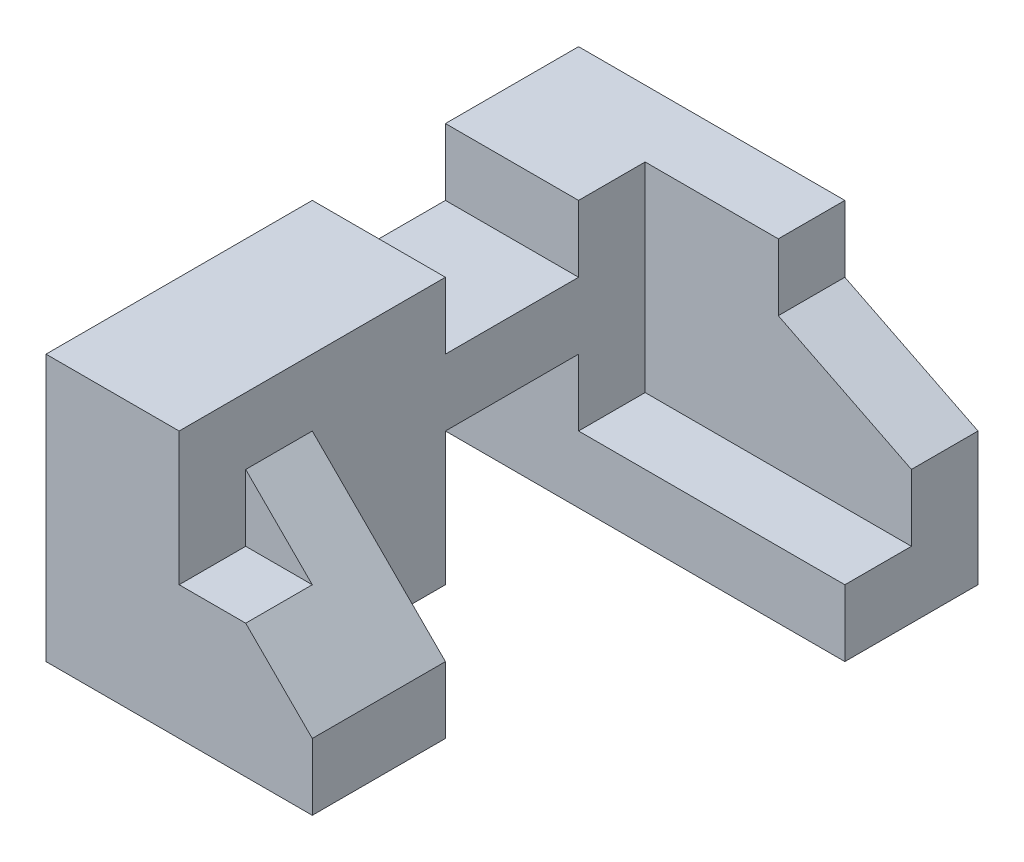
ISO-10303-21;
HEADER;
FILE_DESCRIPTION(('STEP AP214'),'2;1');
FILE_NAME('part.step','',(''),(''),'','','');
FILE_SCHEMA(('AUTOMOTIVE_DESIGN { 1 0 10303 214 1 1 1 1 }'));
ENDSEC;
DATA;
#1=APPLICATION_CONTEXT('core data for automotive mechanical design processes');
#2=APPLICATION_PROTOCOL_DEFINITION('international standard','automotive_design',2000,#1);
#3=PRODUCT_CONTEXT('',#1,'mechanical');
#4=PRODUCT('Part','Part','',(#3));
#5=PRODUCT_RELATED_PRODUCT_CATEGORY('part','',(#4));
#6=PRODUCT_DEFINITION_FORMATION('','',#4);
#7=PRODUCT_DEFINITION_CONTEXT('part definition',#1,'design');
#8=PRODUCT_DEFINITION('design','',#6,#7);
#9=PRODUCT_DEFINITION_SHAPE('','',#8);
#10=(LENGTH_UNIT() NAMED_UNIT(*) SI_UNIT(.MILLI.,.METRE.));
#11=(NAMED_UNIT(*) PLANE_ANGLE_UNIT() SI_UNIT($,.RADIAN.));
#12=(NAMED_UNIT(*) SI_UNIT($,.STERADIAN.) SOLID_ANGLE_UNIT());
#13=UNCERTAINTY_MEASURE_WITH_UNIT(LENGTH_MEASURE(1.E-05),#10,'distance_accuracy_value','');
#14=(GEOMETRIC_REPRESENTATION_CONTEXT(3) GLOBAL_UNCERTAINTY_ASSIGNED_CONTEXT((#13)) GLOBAL_UNIT_ASSIGNED_CONTEXT((#10,
#11,#12)) REPRESENTATION_CONTEXT('',''));
#15=CARTESIAN_POINT('',(0.,0.,0.));
#16=DIRECTION('',(0.,0.,1.));
#17=DIRECTION('',(1.,0.,0.));
#18=AXIS2_PLACEMENT_3D('',#15,#16,#17);
#19=CARTESIAN_POINT('',(3.,-2.,8.));
#20=DIRECTION('',(0.,1.,0.));
#21=DIRECTION('',(-1.,0.,0.));
#22=AXIS2_PLACEMENT_3D('',#19,#20,#21);
#23=PLANE('',#22);
#24=DIRECTION('',(1.,0.,0.));
#25=VECTOR('',#24,1.);
#26=CARTESIAN_POINT('',(-1.,-2.,6.));
#27=LINE('',#26,#25);
#28=CARTESIAN_POINT('',(-1.,-2.,6.));
#29=VERTEX_POINT('',#28);
#30=CARTESIAN_POINT('',(0.999999999999999,-2.,6.));
#31=VERTEX_POINT('',#30);
#32=EDGE_CURVE('E268',#29,#31,#27,.T.);
#33=ORIENTED_EDGE('',*,*,#32,.T.);
#34=DIRECTION('',(0.,0.,1.));
#35=VECTOR('',#34,1.);
#36=CARTESIAN_POINT('',(0.999999999999999,-2.,6.));
#37=LINE('',#36,#35);
#38=CARTESIAN_POINT('',(0.999999999999999,-2.,8.));
#39=VERTEX_POINT('',#38);
#40=EDGE_CURVE('E48',#31,#39,#37,.T.);
#41=ORIENTED_EDGE('',*,*,#40,.T.);
#42=DIRECTION('',(1.,0.,0.));
#43=VECTOR('',#42,1.);
#44=CARTESIAN_POINT('',(3.,-2.,8.));
#45=LINE('',#44,#43);
#46=CARTESIAN_POINT('',(-3.,-2.,8.));
#47=VERTEX_POINT('',#46);
#48=EDGE_CURVE('E327',#47,#39,#45,.T.);
#49=ORIENTED_EDGE('',*,*,#48,.F.);
#50=DIRECTION('',(0.,0.,-1.));
#51=VECTOR('',#50,1.);
#52=CARTESIAN_POINT('',(-3.,-2.,8.));
#53=LINE('',#52,#51);
#54=CARTESIAN_POINT('',(-3.,-2.,4.));
#55=VERTEX_POINT('',#54);
#56=EDGE_CURVE('E11',#47,#55,#53,.T.);
#57=ORIENTED_EDGE('',*,*,#56,.T.);
#58=DIRECTION('',(1.,0.,0.));
#59=VECTOR('',#58,1.);
#60=CARTESIAN_POINT('',(-3.,-2.,4.));
#61=LINE('',#60,#59);
#62=CARTESIAN_POINT('',(-1.,-2.,4.));
#63=VERTEX_POINT('',#62);
#64=EDGE_CURVE('E257',#55,#63,#61,.T.);
#65=ORIENTED_EDGE('',*,*,#64,.T.);
#66=DIRECTION('',(0.,0.,-1.));
#67=VECTOR('',#66,1.);
#68=CARTESIAN_POINT('',(-1.,-2.,2.));
#69=LINE('',#68,#67);
#70=EDGE_CURVE('E265',#29,#63,#69,.T.);
#71=ORIENTED_EDGE('',*,*,#70,.F.);
#72=EDGE_LOOP('',(#33,#41,#49,#57,#65,#71));
#73=FACE_BOUND('',#72,.T.);
#74=ADVANCED_FACE('F33',(#73),#23,.F.);
#75=CARTESIAN_POINT('',(3.,-2.,8.));
#76=DIRECTION('',(-1.,0.,0.));
#77=DIRECTION('',(0.,0.,1.));
#78=AXIS2_PLACEMENT_3D('',#75,#76,#77);
#79=PLANE('',#78);
#80=DIRECTION('',(0.,1.,0.));
#81=VECTOR('',#80,1.);
#82=CARTESIAN_POINT('',(3.,-2.,0.));
#83=LINE('',#82,#81);
#84=CARTESIAN_POINT('',(3.,-2.,0.));
#85=VERTEX_POINT('',#84);
#86=CARTESIAN_POINT('',(3.,0.,0.));
#87=VERTEX_POINT('',#86);
#88=EDGE_CURVE('E339',#85,#87,#83,.T.);
#89=ORIENTED_EDGE('',*,*,#88,.T.);
#90=DIRECTION('',(0.,0.,-1.));
#91=VECTOR('',#90,1.);
#92=CARTESIAN_POINT('',(3.,0.,1.));
#93=LINE('',#92,#91);
#94=CARTESIAN_POINT('',(3.,0.,1.));
#95=VERTEX_POINT('',#94);
#96=EDGE_CURVE('E230',#95,#87,#93,.T.);
#97=ORIENTED_EDGE('',*,*,#96,.F.);
#98=DIRECTION('',(0.,1.,0.));
#99=VECTOR('',#98,1.);
#100=CARTESIAN_POINT('',(3.,2.,1.));
#101=LINE('',#100,#99);
#102=CARTESIAN_POINT('',(3.,-1.,1.));
#103=VERTEX_POINT('',#102);
#104=EDGE_CURVE('E288',#103,#95,#101,.T.);
#105=ORIENTED_EDGE('',*,*,#104,.F.);
#106=DIRECTION('',(0.,0.,-1.));
#107=VECTOR('',#106,1.);
#108=CARTESIAN_POINT('',(3.,-1.,1.));
#109=LINE('',#108,#107);
#110=CARTESIAN_POINT('',(3.,-1.,2.));
#111=VERTEX_POINT('',#110);
#112=EDGE_CURVE('E273',#111,#103,#109,.T.);
#113=ORIENTED_EDGE('',*,*,#112,.F.);
#114=DIRECTION('',(0.,1.,0.));
#115=VECTOR('',#114,1.);
#116=CARTESIAN_POINT('',(3.,-1.,2.));
#117=LINE('',#116,#115);
#118=CARTESIAN_POINT('',(3.,-2.,2.));
#119=VERTEX_POINT('',#118);
#120=EDGE_CURVE('E260',#119,#111,#117,.T.);
#121=ORIENTED_EDGE('',*,*,#120,.F.);
#122=DIRECTION('',(0.,0.,-1.));
#123=VECTOR('',#122,1.);
#124=CARTESIAN_POINT('',(3.,-2.,8.));
#125=LINE('',#124,#123);
#126=EDGE_CURVE('E345',#119,#85,#125,.T.);
#127=ORIENTED_EDGE('',*,*,#126,.T.);
#128=EDGE_LOOP('',(#89,#97,#105,#113,#121,#127));
#129=FACE_BOUND('',#128,.T.);
#130=ADVANCED_FACE('F376',(#129),#79,.F.);
#131=CARTESIAN_POINT('',(3.,2.,8.));
#132=DIRECTION('',(0.,-1.,0.));
#133=DIRECTION('',(0.,0.,-1.));
#134=AXIS2_PLACEMENT_3D('',#131,#132,#133);
#135=PLANE('',#134);
#136=DIRECTION('',(-1.,0.,0.));
#137=VECTOR('',#136,1.);
#138=CARTESIAN_POINT('',(3.,2.,8.));
#139=LINE('',#138,#137);
#140=CARTESIAN_POINT('',(-1.,2.,8.));
#141=VERTEX_POINT('',#140);
#142=CARTESIAN_POINT('',(-3.,2.,8.));
#143=VERTEX_POINT('',#142);
#144=EDGE_CURVE('E331',#141,#143,#139,.T.);
#145=ORIENTED_EDGE('',*,*,#144,.F.);
#146=DIRECTION('',(0.,0.,1.));
#147=VECTOR('',#146,1.);
#148=CARTESIAN_POINT('',(-1.,2.,6.));
#149=LINE('',#148,#147);
#150=CARTESIAN_POINT('',(-1.,2.,4.));
#151=VERTEX_POINT('',#150);
#152=EDGE_CURVE('E279',#151,#141,#149,.T.);
#153=ORIENTED_EDGE('',*,*,#152,.F.);
#154=DIRECTION('',(1.,0.,0.));
#155=VECTOR('',#154,1.);
#156=CARTESIAN_POINT('',(-1.,2.,4.));
#157=LINE('',#156,#155);
#158=CARTESIAN_POINT('',(-3.,2.,4.));
#159=VERTEX_POINT('',#158);
#160=EDGE_CURVE('E294',#159,#151,#157,.T.);
#161=ORIENTED_EDGE('',*,*,#160,.F.);
#162=DIRECTION('',(0.,0.,-1.));
#163=VECTOR('',#162,1.);
#164=CARTESIAN_POINT('',(-3.,2.,8.));
#165=LINE('',#164,#163);
#166=EDGE_CURVE('E343',#143,#159,#165,.T.);
#167=ORIENTED_EDGE('',*,*,#166,.F.);
#168=EDGE_LOOP('',(#145,#153,#161,#167));
#169=FACE_BOUND('',#168,.T.);
#170=ADVANCED_FACE('F410',(#169),#135,.F.);
#171=CARTESIAN_POINT('',(-3.,-2.,8.));
#172=DIRECTION('',(1.,0.,0.));
#173=DIRECTION('',(0.,0.,-1.));
#174=AXIS2_PLACEMENT_3D('',#171,#172,#173);
#175=PLANE('',#174);
#176=DIRECTION('',(0.,0.,1.));
#177=VECTOR('',#176,1.);
#178=CARTESIAN_POINT('',(-3.,0.,2.));
#179=LINE('',#178,#177);
#180=CARTESIAN_POINT('',(-3.,0.,2.));
#181=VERTEX_POINT('',#180);
#182=CARTESIAN_POINT('',(-3.,0.,4.));
#183=VERTEX_POINT('',#182);
#184=EDGE_CURVE('E244',#181,#183,#179,.T.);
#185=ORIENTED_EDGE('',*,*,#184,.T.);
#186=DIRECTION('',(0.,-1.,0.));
#187=VECTOR('',#186,1.);
#188=CARTESIAN_POINT('',(-3.,0.,4.));
#189=LINE('',#188,#187);
#190=EDGE_CURVE('E248',#183,#55,#189,.T.);
#191=ORIENTED_EDGE('',*,*,#190,.T.);
#192=ORIENTED_EDGE('',*,*,#56,.F.);
#193=DIRECTION('',(0.,-1.,0.));
#194=VECTOR('',#193,1.);
#195=CARTESIAN_POINT('',(-3.,-2.,8.));
#196=LINE('',#195,#194);
#197=EDGE_CURVE('E324',#143,#47,#196,.T.);
#198=ORIENTED_EDGE('',*,*,#197,.F.);
#199=ORIENTED_EDGE('',*,*,#166,.T.);
#200=DIRECTION('',(0.,1.,0.));
#201=VECTOR('',#200,1.);
#202=CARTESIAN_POINT('',(-3.,1.,4.));
#203=LINE('',#202,#201);
#204=CARTESIAN_POINT('',(-3.,1.,4.));
#205=VERTEX_POINT('',#204);
#206=EDGE_CURVE('E310',#205,#159,#203,.T.);
#207=ORIENTED_EDGE('',*,*,#206,.F.);
#208=DIRECTION('',(0.,0.,1.));
#209=VECTOR('',#208,1.);
#210=CARTESIAN_POINT('',(-3.,1.,4.));
#211=LINE('',#210,#209);
#212=CARTESIAN_POINT('',(-3.,1.,2.));
#213=VERTEX_POINT('',#212);
#214=EDGE_CURVE('E297',#213,#205,#211,.T.);
#215=ORIENTED_EDGE('',*,*,#214,.F.);
#216=DIRECTION('',(0.,1.,0.));
#217=VECTOR('',#216,1.);
#218=CARTESIAN_POINT('',(-3.,1.,2.));
#219=LINE('',#218,#217);
#220=CARTESIAN_POINT('',(-3.,2.,2.));
#221=VERTEX_POINT('',#220);
#222=EDGE_CURVE('E314',#213,#221,#219,.T.);
#223=ORIENTED_EDGE('',*,*,#222,.T.);
#224=CARTESIAN_POINT('',(-3.,2.,0.));
#225=VERTEX_POINT('',#224);
#226=EDGE_CURVE('E333',#221,#225,#165,.T.);
#227=ORIENTED_EDGE('',*,*,#226,.T.);
#228=DIRECTION('',(0.,-1.,0.));
#229=VECTOR('',#228,1.);
#230=CARTESIAN_POINT('',(-3.,-2.,0.));
#231=LINE('',#230,#229);
#232=CARTESIAN_POINT('',(-3.,-2.,0.));
#233=VERTEX_POINT('',#232);
#234=EDGE_CURVE('E317',#225,#233,#231,.T.);
#235=ORIENTED_EDGE('',*,*,#234,.T.);
#236=CARTESIAN_POINT('',(-3.,-2.,2.));
#237=VERTEX_POINT('',#236);
#238=EDGE_CURVE('E41',#237,#233,#53,.T.);
#239=ORIENTED_EDGE('',*,*,#238,.F.);
#240=DIRECTION('',(0.,1.,0.));
#241=VECTOR('',#240,1.);
#242=CARTESIAN_POINT('',(-3.,-2.,2.));
#243=LINE('',#242,#241);
#244=EDGE_CURVE('E241',#237,#181,#243,.T.);
#245=ORIENTED_EDGE('',*,*,#244,.T.);
#246=EDGE_LOOP('',(#185,#191,#192,#198,#199,#207,#215,#223,#227,#235,#239,#245));
#247=FACE_BOUND('',#246,.T.);
#248=ADVANCED_FACE('F35',(#247),#175,.F.);
#249=DIRECTION('',(1.,0.,0.));
#250=VECTOR('',#249,1.);
#251=CARTESIAN_POINT('',(-1.,-2.,2.));
#252=LINE('',#251,#250);
#253=EDGE_CURVE('E274',#237,#119,#252,.T.);
#254=ORIENTED_EDGE('',*,*,#253,.F.);
#255=ORIENTED_EDGE('',*,*,#238,.T.);
#256=DIRECTION('',(1.,0.,0.));
#257=VECTOR('',#256,1.);
#258=CARTESIAN_POINT('',(3.,-2.,0.));
#259=LINE('',#258,#257);
#260=EDGE_CURVE('E336',#233,#85,#259,.T.);
#261=ORIENTED_EDGE('',*,*,#260,.T.);
#262=ORIENTED_EDGE('',*,*,#126,.F.);
#263=EDGE_LOOP('',(#254,#255,#261,#262));
#264=FACE_BOUND('',#263,.T.);
#265=ADVANCED_FACE('F352',(#264),#23,.F.);
#266=DIRECTION('',(1.,0.,0.));
#267=VECTOR('',#266,1.);
#268=CARTESIAN_POINT('',(-1.,2.,1.));
#269=LINE('',#268,#267);
#270=CARTESIAN_POINT('',(-1.,2.,1.));
#271=VERTEX_POINT('',#270);
#272=CARTESIAN_POINT('',(0.999999999999999,2.,1.));
#273=VERTEX_POINT('',#272);
#274=EDGE_CURVE('E291',#271,#273,#269,.T.);
#275=ORIENTED_EDGE('',*,*,#274,.T.);
#276=DIRECTION('',(0.,0.,-1.));
#277=VECTOR('',#276,1.);
#278=CARTESIAN_POINT('',(0.999999999999999,2.,1.));
#279=LINE('',#278,#277);
#280=CARTESIAN_POINT('',(0.999999999999999,2.,0.));
#281=VERTEX_POINT('',#280);
#282=EDGE_CURVE('E234',#273,#281,#279,.T.);
#283=ORIENTED_EDGE('',*,*,#282,.T.);
#284=DIRECTION('',(-1.,0.,0.));
#285=VECTOR('',#284,1.);
#286=CARTESIAN_POINT('',(3.,2.,0.));
#287=LINE('',#286,#285);
#288=EDGE_CURVE('E328',#281,#225,#287,.T.);
#289=ORIENTED_EDGE('',*,*,#288,.T.);
#290=ORIENTED_EDGE('',*,*,#226,.F.);
#291=DIRECTION('',(-1.,0.,0.));
#292=VECTOR('',#291,1.);
#293=CARTESIAN_POINT('',(-3.,2.,2.));
#294=LINE('',#293,#292);
#295=CARTESIAN_POINT('',(-1.,2.,2.));
#296=VERTEX_POINT('',#295);
#297=EDGE_CURVE('E301',#296,#221,#294,.T.);
#298=ORIENTED_EDGE('',*,*,#297,.F.);
#299=EDGE_CURVE('E277',#271,#296,#149,.T.);
#300=ORIENTED_EDGE('',*,*,#299,.F.);
#301=EDGE_LOOP('',(#275,#283,#289,#290,#298,#300));
#302=FACE_BOUND('',#301,.T.);
#303=ADVANCED_FACE('F366',(#302),#135,.F.);
#304=CARTESIAN_POINT('',(0.,0.,8.));
#305=DIRECTION('',(0.,0.,1.));
#306=DIRECTION('',(1.,0.,0.));
#307=AXIS2_PLACEMENT_3D('',#304,#305,#306);
#308=PLANE('',#307);
#309=DIRECTION('',(0.707106781186548,-0.707106781186548,0.));
#310=VECTOR('',#309,1.);
#311=CARTESIAN_POINT('',(0.999999999999999,-1.,8.));
#312=LINE('',#311,#310);
#313=CARTESIAN_POINT('',(0.,0.,8.));
#314=VERTEX_POINT('',#313);
#315=CARTESIAN_POINT('',(0.999999999999999,-1.,8.));
#316=VERTEX_POINT('',#315);
#317=EDGE_CURVE('E190',#314,#316,#312,.T.);
#318=ORIENTED_EDGE('',*,*,#317,.F.);
#319=DIRECTION('',(1.,0.,0.));
#320=VECTOR('',#319,1.);
#321=CARTESIAN_POINT('',(0.,0.,8.));
#322=LINE('',#321,#320);
#323=CARTESIAN_POINT('',(-1.,0.,8.));
#324=VERTEX_POINT('',#323);
#325=EDGE_CURVE('E205',#324,#314,#322,.T.);
#326=ORIENTED_EDGE('',*,*,#325,.F.);
#327=DIRECTION('',(0.,1.,0.));
#328=VECTOR('',#327,1.);
#329=CARTESIAN_POINT('',(-1.,0.,8.));
#330=LINE('',#329,#328);
#331=EDGE_CURVE('E218',#324,#141,#330,.T.);
#332=ORIENTED_EDGE('',*,*,#331,.T.);
#333=ORIENTED_EDGE('',*,*,#144,.T.);
#334=ORIENTED_EDGE('',*,*,#197,.T.);
#335=ORIENTED_EDGE('',*,*,#48,.T.);
#336=DIRECTION('',(0.,1.,0.));
#337=VECTOR('',#336,1.);
#338=CARTESIAN_POINT('',(0.999999999999999,-2.,8.));
#339=LINE('',#338,#337);
#340=EDGE_CURVE('E203',#39,#316,#339,.T.);
#341=ORIENTED_EDGE('',*,*,#340,.T.);
#342=EDGE_LOOP('',(#318,#326,#332,#333,#334,#335,#341));
#343=FACE_BOUND('',#342,.T.);
#344=ADVANCED_FACE('F403',(#343),#308,.T.);
#345=CARTESIAN_POINT('',(0.,0.,0.));
#346=DIRECTION('',(0.,0.,1.));
#347=DIRECTION('',(1.,0.,0.));
#348=AXIS2_PLACEMENT_3D('',#345,#346,#347);
#349=PLANE('',#348);
#350=ORIENTED_EDGE('',*,*,#288,.F.);
#351=DIRECTION('',(0.,1.,0.));
#352=VECTOR('',#351,1.);
#353=CARTESIAN_POINT('',(0.999999999999999,2.,0.));
#354=LINE('',#353,#352);
#355=CARTESIAN_POINT('',(0.999999999999999,1.,0.));
#356=VERTEX_POINT('',#355);
#357=EDGE_CURVE('E227',#356,#281,#354,.T.);
#358=ORIENTED_EDGE('',*,*,#357,.F.);
#359=DIRECTION('',(-0.894427190999916,0.447213595499958,0.));
#360=VECTOR('',#359,1.);
#361=CARTESIAN_POINT('',(0.999999999999999,1.,0.));
#362=LINE('',#361,#360);
#363=EDGE_CURVE('E220',#87,#356,#362,.T.);
#364=ORIENTED_EDGE('',*,*,#363,.F.);
#365=ORIENTED_EDGE('',*,*,#88,.F.);
#366=ORIENTED_EDGE('',*,*,#260,.F.);
#367=ORIENTED_EDGE('',*,*,#234,.F.);
#368=EDGE_LOOP('',(#350,#358,#364,#365,#366,#367));
#369=FACE_BOUND('',#368,.T.);
#370=ADVANCED_FACE('F359',(#369),#349,.F.);
#371=CARTESIAN_POINT('',(-3.,1.,2.));
#372=DIRECTION('',(0.,0.,-1.));
#373=DIRECTION('',(-1.,0.,0.));
#374=AXIS2_PLACEMENT_3D('',#371,#372,#373);
#375=PLANE('',#374);
#376=ORIENTED_EDGE('',*,*,#297,.T.);
#377=ORIENTED_EDGE('',*,*,#222,.F.);
#378=DIRECTION('',(-1.,0.,0.));
#379=VECTOR('',#378,1.);
#380=CARTESIAN_POINT('',(-3.,1.,2.));
#381=LINE('',#380,#379);
#382=CARTESIAN_POINT('',(-1.,1.,2.));
#383=VERTEX_POINT('',#382);
#384=EDGE_CURVE('E307',#383,#213,#381,.T.);
#385=ORIENTED_EDGE('',*,*,#384,.F.);
#386=DIRECTION('',(0.,1.,0.));
#387=VECTOR('',#386,1.);
#388=CARTESIAN_POINT('',(-1.,1.,2.));
#389=LINE('',#388,#387);
#390=EDGE_CURVE('E318',#383,#296,#389,.T.);
#391=ORIENTED_EDGE('',*,*,#390,.T.);
#392=EDGE_LOOP('',(#376,#377,#385,#391));
#393=FACE_BOUND('',#392,.T.);
#394=ADVANCED_FACE('F419',(#393),#375,.F.);
#395=CARTESIAN_POINT('',(-1.,1.,4.));
#396=DIRECTION('',(0.,0.,1.));
#397=DIRECTION('',(1.,0.,0.));
#398=AXIS2_PLACEMENT_3D('',#395,#396,#397);
#399=PLANE('',#398);
#400=ORIENTED_EDGE('',*,*,#160,.T.);
#401=DIRECTION('',(0.,1.,0.));
#402=VECTOR('',#401,1.);
#403=CARTESIAN_POINT('',(-1.,1.,4.));
#404=LINE('',#403,#402);
#405=CARTESIAN_POINT('',(-1.,1.,4.));
#406=VERTEX_POINT('',#405);
#407=EDGE_CURVE('E321',#406,#151,#404,.T.);
#408=ORIENTED_EDGE('',*,*,#407,.F.);
#409=DIRECTION('',(1.,0.,0.));
#410=VECTOR('',#409,1.);
#411=CARTESIAN_POINT('',(-1.,1.,4.));
#412=LINE('',#411,#410);
#413=EDGE_CURVE('E300',#205,#406,#412,.T.);
#414=ORIENTED_EDGE('',*,*,#413,.F.);
#415=ORIENTED_EDGE('',*,*,#206,.T.);
#416=EDGE_LOOP('',(#400,#408,#414,#415));
#417=FACE_BOUND('',#416,.T.);
#418=ADVANCED_FACE('F414',(#417),#399,.F.);
#419=CARTESIAN_POINT('',(0.,1.,0.));
#420=DIRECTION('',(0.,-1.,0.));
#421=DIRECTION('',(0.,0.,-1.));
#422=AXIS2_PLACEMENT_3D('',#419,#420,#421);
#423=PLANE('',#422);
#424=ORIENTED_EDGE('',*,*,#214,.T.);
#425=ORIENTED_EDGE('',*,*,#413,.T.);
#426=DIRECTION('',(0.,0.,-1.));
#427=VECTOR('',#426,1.);
#428=CARTESIAN_POINT('',(-1.,1.,2.));
#429=LINE('',#428,#427);
#430=EDGE_CURVE('E304',#406,#383,#429,.T.);
#431=ORIENTED_EDGE('',*,*,#430,.T.);
#432=ORIENTED_EDGE('',*,*,#384,.T.);
#433=EDGE_LOOP('',(#424,#425,#431,#432));
#434=FACE_BOUND('',#433,.T.);
#435=ADVANCED_FACE('F416',(#434),#423,.F.);
#436=CARTESIAN_POINT('',(-1.,0.,0.));
#437=DIRECTION('',(-1.,0.,0.));
#438=DIRECTION('',(0.,0.,1.));
#439=AXIS2_PLACEMENT_3D('',#436,#437,#438);
#440=PLANE('',#439);
#441=ORIENTED_EDGE('',*,*,#152,.T.);
#442=ORIENTED_EDGE('',*,*,#331,.F.);
#443=DIRECTION('',(0.,0.,1.));
#444=VECTOR('',#443,1.);
#445=CARTESIAN_POINT('',(-1.,0.,8.));
#446=LINE('',#445,#444);
#447=CARTESIAN_POINT('',(-1.,0.,7.));
#448=VERTEX_POINT('',#447);
#449=EDGE_CURVE('E56',#448,#324,#446,.T.);
#450=ORIENTED_EDGE('',*,*,#449,.F.);
#451=DIRECTION('',(0.,1.,0.));
#452=VECTOR('',#451,1.);
#453=CARTESIAN_POINT('',(-1.,0.,7.));
#454=LINE('',#453,#452);
#455=CARTESIAN_POINT('',(-1.,1.,7.));
#456=VERTEX_POINT('',#455);
#457=EDGE_CURVE('E217',#448,#456,#454,.T.);
#458=ORIENTED_EDGE('',*,*,#457,.T.);
#459=DIRECTION('',(0.,0.,-1.));
#460=VECTOR('',#459,1.);
#461=CARTESIAN_POINT('',(-1.,1.,6.));
#462=LINE('',#461,#460);
#463=CARTESIAN_POINT('',(-1.,1.,6.));
#464=VERTEX_POINT('',#463);
#465=EDGE_CURVE('E207',#456,#464,#462,.T.);
#466=ORIENTED_EDGE('',*,*,#465,.T.);
#467=DIRECTION('',(0.,-1.,0.));
#468=VECTOR('',#467,1.);
#469=CARTESIAN_POINT('',(-1.,-1.,6.));
#470=LINE('',#469,#468);
#471=EDGE_CURVE('E200',#464,#29,#470,.T.);
#472=ORIENTED_EDGE('',*,*,#471,.T.);
#473=ORIENTED_EDGE('',*,*,#70,.T.);
#474=DIRECTION('',(0.,-1.,0.));
#475=VECTOR('',#474,1.);
#476=CARTESIAN_POINT('',(-1.,0.,4.));
#477=LINE('',#476,#475);
#478=CARTESIAN_POINT('',(-1.,0.,4.));
#479=VERTEX_POINT('',#478);
#480=EDGE_CURVE('E245',#479,#63,#477,.T.);
#481=ORIENTED_EDGE('',*,*,#480,.F.);
#482=DIRECTION('',(0.,0.,1.));
#483=VECTOR('',#482,1.);
#484=CARTESIAN_POINT('',(-1.,0.,2.));
#485=LINE('',#484,#483);
#486=CARTESIAN_POINT('',(-1.,0.,2.));
#487=VERTEX_POINT('',#486);
#488=EDGE_CURVE('E253',#487,#479,#485,.T.);
#489=ORIENTED_EDGE('',*,*,#488,.F.);
#490=DIRECTION('',(0.,1.,0.));
#491=VECTOR('',#490,1.);
#492=CARTESIAN_POINT('',(-1.,-2.,2.));
#493=LINE('',#492,#491);
#494=CARTESIAN_POINT('',(-1.,-1.,2.));
#495=VERTEX_POINT('',#494);
#496=EDGE_CURVE('E237',#495,#487,#493,.T.);
#497=ORIENTED_EDGE('',*,*,#496,.F.);
#498=DIRECTION('',(0.,0.,-1.));
#499=VECTOR('',#498,1.);
#500=CARTESIAN_POINT('',(-1.,-1.,1.));
#501=LINE('',#500,#499);
#502=CARTESIAN_POINT('',(-1.,-1.,1.));
#503=VERTEX_POINT('',#502);
#504=EDGE_CURVE('E281',#495,#503,#501,.T.);
#505=ORIENTED_EDGE('',*,*,#504,.T.);
#506=DIRECTION('',(0.,1.,0.));
#507=VECTOR('',#506,1.);
#508=CARTESIAN_POINT('',(-1.,2.,1.));
#509=LINE('',#508,#507);
#510=EDGE_CURVE('E283',#503,#271,#509,.T.);
#511=ORIENTED_EDGE('',*,*,#510,.T.);
#512=ORIENTED_EDGE('',*,*,#299,.T.);
#513=ORIENTED_EDGE('',*,*,#390,.F.);
#514=ORIENTED_EDGE('',*,*,#430,.F.);
#515=ORIENTED_EDGE('',*,*,#407,.T.);
#516=EDGE_LOOP('',(#441,#442,#450,#458,#466,#472,#473,#481,#489,#497,#505,#511,#512,#513,#514,#515));
#517=FACE_BOUND('',#516,.T.);
#518=ADVANCED_FACE('F401',(#517),#440,.F.);
#519=CARTESIAN_POINT('',(-1.,2.,1.));
#520=DIRECTION('',(0.,0.,-1.));
#521=DIRECTION('',(-1.,0.,0.));
#522=AXIS2_PLACEMENT_3D('',#519,#520,#521);
#523=PLANE('',#522);
#524=DIRECTION('',(-0.894427190999916,0.447213595499958,0.));
#525=VECTOR('',#524,1.);
#526=CARTESIAN_POINT('',(0.999999999999999,1.,1.));
#527=LINE('',#526,#525);
#528=CARTESIAN_POINT('',(0.999999999999999,1.,1.));
#529=VERTEX_POINT('',#528);
#530=EDGE_CURVE('E223',#95,#529,#527,.T.);
#531=ORIENTED_EDGE('',*,*,#530,.T.);
#532=DIRECTION('',(0.,1.,0.));
#533=VECTOR('',#532,1.);
#534=CARTESIAN_POINT('',(0.999999999999999,2.,1.));
#535=LINE('',#534,#533);
#536=EDGE_CURVE('E226',#529,#273,#535,.T.);
#537=ORIENTED_EDGE('',*,*,#536,.T.);
#538=ORIENTED_EDGE('',*,*,#274,.F.);
#539=ORIENTED_EDGE('',*,*,#510,.F.);
#540=DIRECTION('',(1.,0.,0.));
#541=VECTOR('',#540,1.);
#542=CARTESIAN_POINT('',(-1.,-1.,1.));
#543=LINE('',#542,#541);
#544=EDGE_CURVE('E286',#503,#103,#543,.T.);
#545=ORIENTED_EDGE('',*,*,#544,.T.);
#546=ORIENTED_EDGE('',*,*,#104,.T.);
#547=EDGE_LOOP('',(#531,#537,#538,#539,#545,#546));
#548=FACE_BOUND('',#547,.T.);
#549=ADVANCED_FACE('F379',(#548),#523,.F.);
#550=CARTESIAN_POINT('',(-1.,-1.,1.));
#551=DIRECTION('',(0.,-1.,0.));
#552=DIRECTION('',(0.,0.,-1.));
#553=AXIS2_PLACEMENT_3D('',#550,#551,#552);
#554=PLANE('',#553);
#555=ORIENTED_EDGE('',*,*,#504,.F.);
#556=DIRECTION('',(1.,0.,0.));
#557=VECTOR('',#556,1.);
#558=CARTESIAN_POINT('',(-1.,-1.,2.));
#559=LINE('',#558,#557);
#560=EDGE_CURVE('E270',#495,#111,#559,.T.);
#561=ORIENTED_EDGE('',*,*,#560,.T.);
#562=ORIENTED_EDGE('',*,*,#112,.T.);
#563=ORIENTED_EDGE('',*,*,#544,.F.);
#564=EDGE_LOOP('',(#555,#561,#562,#563));
#565=FACE_BOUND('',#564,.T.);
#566=ADVANCED_FACE('F384',(#565),#554,.F.);
#567=CARTESIAN_POINT('',(-1.,-1.,6.));
#568=DIRECTION('',(0.,0.,1.));
#569=DIRECTION('',(1.,0.,0.));
#570=AXIS2_PLACEMENT_3D('',#567,#568,#569);
#571=PLANE('',#570);
#572=ORIENTED_EDGE('',*,*,#471,.F.);
#573=DIRECTION('',(0.707106781186548,-0.707106781186548,0.));
#574=VECTOR('',#573,1.);
#575=CARTESIAN_POINT('',(0.999999999999999,-1.,6.));
#576=LINE('',#575,#574);
#577=CARTESIAN_POINT('',(0.999999999999999,-1.,6.));
#578=VERTEX_POINT('',#577);
#579=EDGE_CURVE('E187',#464,#578,#576,.T.);
#580=ORIENTED_EDGE('',*,*,#579,.T.);
#581=DIRECTION('',(0.,1.,0.));
#582=VECTOR('',#581,1.);
#583=CARTESIAN_POINT('',(0.999999999999999,-2.,6.));
#584=LINE('',#583,#582);
#585=EDGE_CURVE('E198',#31,#578,#584,.T.);
#586=ORIENTED_EDGE('',*,*,#585,.F.);
#587=ORIENTED_EDGE('',*,*,#32,.F.);
#588=EDGE_LOOP('',(#572,#580,#586,#587));
#589=FACE_BOUND('',#588,.T.);
#590=ADVANCED_FACE('F196',(#589),#571,.F.);
#591=CARTESIAN_POINT('',(-1.,-1.,2.));
#592=DIRECTION('',(0.,0.,-1.));
#593=DIRECTION('',(-1.,0.,0.));
#594=AXIS2_PLACEMENT_3D('',#591,#592,#593);
#595=PLANE('',#594);
#596=ORIENTED_EDGE('',*,*,#120,.T.);
#597=ORIENTED_EDGE('',*,*,#560,.F.);
#598=ORIENTED_EDGE('',*,*,#496,.T.);
#599=DIRECTION('',(1.,0.,0.));
#600=VECTOR('',#599,1.);
#601=CARTESIAN_POINT('',(-3.,0.,2.));
#602=LINE('',#601,#600);
#603=EDGE_CURVE('E251',#181,#487,#602,.T.);
#604=ORIENTED_EDGE('',*,*,#603,.F.);
#605=ORIENTED_EDGE('',*,*,#244,.F.);
#606=ORIENTED_EDGE('',*,*,#253,.T.);
#607=EDGE_LOOP('',(#596,#597,#598,#604,#605,#606));
#608=FACE_BOUND('',#607,.T.);
#609=ADVANCED_FACE('F387',(#608),#595,.F.);
#610=CARTESIAN_POINT('',(-3.,0.,4.));
#611=DIRECTION('',(0.,0.,1.));
#612=DIRECTION('',(1.,0.,0.));
#613=AXIS2_PLACEMENT_3D('',#610,#611,#612);
#614=PLANE('',#613);
#615=ORIENTED_EDGE('',*,*,#480,.T.);
#616=ORIENTED_EDGE('',*,*,#64,.F.);
#617=ORIENTED_EDGE('',*,*,#190,.F.);
#618=DIRECTION('',(1.,0.,0.));
#619=VECTOR('',#618,1.);
#620=CARTESIAN_POINT('',(-3.,0.,4.));
#621=LINE('',#620,#619);
#622=EDGE_CURVE('E261',#183,#479,#621,.T.);
#623=ORIENTED_EDGE('',*,*,#622,.T.);
#624=EDGE_LOOP('',(#615,#616,#617,#623));
#625=FACE_BOUND('',#624,.T.);
#626=ADVANCED_FACE('F396',(#625),#614,.F.);
#627=CARTESIAN_POINT('',(-3.,0.,2.));
#628=DIRECTION('',(0.,1.,0.));
#629=DIRECTION('',(0.,0.,1.));
#630=AXIS2_PLACEMENT_3D('',#627,#628,#629);
#631=PLANE('',#630);
#632=ORIENTED_EDGE('',*,*,#488,.T.);
#633=ORIENTED_EDGE('',*,*,#622,.F.);
#634=ORIENTED_EDGE('',*,*,#184,.F.);
#635=ORIENTED_EDGE('',*,*,#603,.T.);
#636=EDGE_LOOP('',(#632,#633,#634,#635));
#637=FACE_BOUND('',#636,.T.);
#638=ADVANCED_FACE('F392',(#637),#631,.F.);
#639=CARTESIAN_POINT('',(0.999999999999999,2.,1.));
#640=DIRECTION('',(-1.,0.,0.));
#641=DIRECTION('',(0.,-1.,0.));
#642=AXIS2_PLACEMENT_3D('',#639,#640,#641);
#643=PLANE('',#642);
#644=ORIENTED_EDGE('',*,*,#357,.T.);
#645=ORIENTED_EDGE('',*,*,#282,.F.);
#646=ORIENTED_EDGE('',*,*,#536,.F.);
#647=DIRECTION('',(0.,0.,-1.));
#648=VECTOR('',#647,1.);
#649=CARTESIAN_POINT('',(0.999999999999999,1.,1.));
#650=LINE('',#649,#648);
#651=EDGE_CURVE('E238',#529,#356,#650,.T.);
#652=ORIENTED_EDGE('',*,*,#651,.T.);
#653=EDGE_LOOP('',(#644,#645,#646,#652));
#654=FACE_BOUND('',#653,.T.);
#655=ADVANCED_FACE('F370',(#654),#643,.F.);
#656=CARTESIAN_POINT('',(0.999999999999999,1.,1.));
#657=DIRECTION('',(-0.447213595499958,-0.894427190999916,0.));
#658=DIRECTION('',(0.894427190999916,-0.447213595499958,0.));
#659=AXIS2_PLACEMENT_3D('',#656,#657,#658);
#660=PLANE('',#659);
#661=ORIENTED_EDGE('',*,*,#363,.T.);
#662=ORIENTED_EDGE('',*,*,#651,.F.);
#663=ORIENTED_EDGE('',*,*,#530,.F.);
#664=ORIENTED_EDGE('',*,*,#96,.T.);
#665=EDGE_LOOP('',(#661,#662,#663,#664));
#666=FACE_BOUND('',#665,.T.);
#667=ADVANCED_FACE('F373',(#666),#660,.F.);
#668=CARTESIAN_POINT('',(-1.,0.,7.));
#669=DIRECTION('',(0.,0.,-1.));
#670=DIRECTION('',(-1.,0.,0.));
#671=AXIS2_PLACEMENT_3D('',#668,#669,#670);
#672=PLANE('',#671);
#673=DIRECTION('',(-1.,0.,0.));
#674=VECTOR('',#673,1.);
#675=CARTESIAN_POINT('',(-1.,0.,7.));
#676=LINE('',#675,#674);
#677=CARTESIAN_POINT('',(0.,0.,7.));
#678=VERTEX_POINT('',#677);
#679=EDGE_CURVE('E214',#678,#448,#676,.T.);
#680=ORIENTED_EDGE('',*,*,#679,.F.);
#681=DIRECTION('',(-0.707106781186548,0.707106781186548,0.));
#682=VECTOR('',#681,1.);
#683=CARTESIAN_POINT('',(-0.500000000000001,0.5,7.));
#684=LINE('',#683,#682);
#685=EDGE_CURVE('E192',#678,#456,#684,.T.);
#686=ORIENTED_EDGE('',*,*,#685,.T.);
#687=ORIENTED_EDGE('',*,*,#457,.F.);
#688=EDGE_LOOP('',(#680,#686,#687));
#689=FACE_BOUND('',#688,.T.);
#690=ADVANCED_FACE('F426',(#689),#672,.F.);
#691=CARTESIAN_POINT('',(0.,0.,0.));
#692=DIRECTION('',(0.,-1.,0.));
#693=DIRECTION('',(0.,0.,-1.));
#694=AXIS2_PLACEMENT_3D('',#691,#692,#693);
#695=PLANE('',#694);
#696=ORIENTED_EDGE('',*,*,#325,.T.);
#697=DIRECTION('',(0.,0.,-1.));
#698=VECTOR('',#697,1.);
#699=CARTESIAN_POINT('',(0.,0.,7.));
#700=LINE('',#699,#698);
#701=EDGE_CURVE('E211',#314,#678,#700,.T.);
#702=ORIENTED_EDGE('',*,*,#701,.T.);
#703=ORIENTED_EDGE('',*,*,#679,.T.);
#704=ORIENTED_EDGE('',*,*,#449,.T.);
#705=EDGE_LOOP('',(#696,#702,#703,#704));
#706=FACE_BOUND('',#705,.T.);
#707=ADVANCED_FACE('F421',(#706),#695,.F.);
#708=CARTESIAN_POINT('',(0.999999999999999,-2.,6.));
#709=DIRECTION('',(-1.,0.,0.));
#710=DIRECTION('',(0.,0.,1.));
#711=AXIS2_PLACEMENT_3D('',#708,#709,#710);
#712=PLANE('',#711);
#713=ORIENTED_EDGE('',*,*,#585,.T.);
#714=DIRECTION('',(0.,0.,1.));
#715=VECTOR('',#714,1.);
#716=CARTESIAN_POINT('',(0.999999999999999,-1.,6.));
#717=LINE('',#716,#715);
#718=EDGE_CURVE('E184',#578,#316,#717,.T.);
#719=ORIENTED_EDGE('',*,*,#718,.T.);
#720=ORIENTED_EDGE('',*,*,#340,.F.);
#721=ORIENTED_EDGE('',*,*,#40,.F.);
#722=EDGE_LOOP('',(#713,#719,#720,#721));
#723=FACE_BOUND('',#722,.T.);
#724=ADVANCED_FACE('F202',(#723),#712,.F.);
#725=CARTESIAN_POINT('',(0.999999999999999,-1.,6.));
#726=DIRECTION('',(-0.707106781186547,-0.707106781186547,0.));
#727=DIRECTION('',(0.707106781186548,-0.707106781186548,0.));
#728=AXIS2_PLACEMENT_3D('',#725,#726,#727);
#729=PLANE('',#728);
#730=ORIENTED_EDGE('',*,*,#701,.F.);
#731=ORIENTED_EDGE('',*,*,#317,.T.);
#732=ORIENTED_EDGE('',*,*,#718,.F.);
#733=ORIENTED_EDGE('',*,*,#579,.F.);
#734=ORIENTED_EDGE('',*,*,#465,.F.);
#735=ORIENTED_EDGE('',*,*,#685,.F.);
#736=EDGE_LOOP('',(#730,#731,#732,#733,#734,#735));
#737=FACE_BOUND('',#736,.T.);
#738=ADVANCED_FACE('F186',(#737),#729,.F.);
#739=CLOSED_SHELL('',(#74,#130,#170,#248,#265,#303,#344,#370,#394,#418,#435,#518,#549,#566,#590,
#609,#626,#638,#655,#667,#690,#707,#724,#738));
#740=MANIFOLD_SOLID_BREP('B2',#739);
#741=ADVANCED_BREP_SHAPE_REPRESENTATION('',(#18,#740),#14);
#742=SHAPE_DEFINITION_REPRESENTATION(#9,#741);
ENDSEC;
END-ISO-10303-21;
